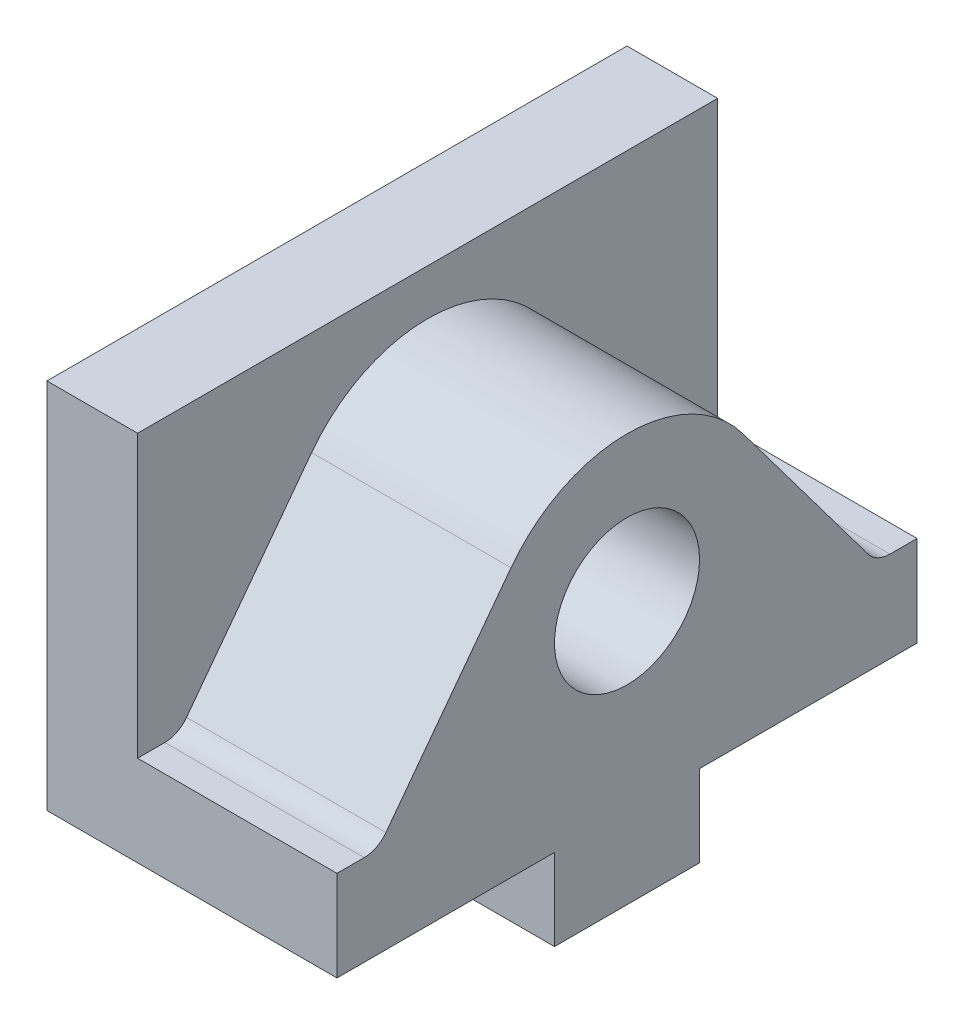
ISO-10303-21;
HEADER;
FILE_DESCRIPTION(('STEP AP214'),'2;1');
FILE_NAME('part.step','',(''),(''),'','','');
FILE_SCHEMA(('AUTOMOTIVE_DESIGN { 1 0 10303 214 1 1 1 1 }'));
ENDSEC;
DATA;
#1=APPLICATION_CONTEXT('core data for automotive mechanical design processes');
#2=APPLICATION_PROTOCOL_DEFINITION('international standard','automotive_design',2000,#1);
#3=PRODUCT_CONTEXT('',#1,'mechanical');
#4=PRODUCT('Part','Part','',(#3));
#5=PRODUCT_RELATED_PRODUCT_CATEGORY('part','',(#4));
#6=PRODUCT_DEFINITION_FORMATION('','',#4);
#7=PRODUCT_DEFINITION_CONTEXT('part definition',#1,'design');
#8=PRODUCT_DEFINITION('design','',#6,#7);
#9=PRODUCT_DEFINITION_SHAPE('','',#8);
#10=(LENGTH_UNIT() NAMED_UNIT(*) SI_UNIT(.MILLI.,.METRE.));
#11=(NAMED_UNIT(*) PLANE_ANGLE_UNIT() SI_UNIT($,.RADIAN.));
#12=(NAMED_UNIT(*) SI_UNIT($,.STERADIAN.) SOLID_ANGLE_UNIT());
#13=UNCERTAINTY_MEASURE_WITH_UNIT(LENGTH_MEASURE(1.E-05),#10,'distance_accuracy_value','');
#14=(GEOMETRIC_REPRESENTATION_CONTEXT(3) GLOBAL_UNCERTAINTY_ASSIGNED_CONTEXT((#13)) GLOBAL_UNIT_ASSIGNED_CONTEXT((#10,
#11,#12)) REPRESENTATION_CONTEXT('',''));
#15=CARTESIAN_POINT('',(0.,0.,0.));
#16=DIRECTION('',(0.,0.,1.));
#17=DIRECTION('',(1.,0.,0.));
#18=AXIS2_PLACEMENT_3D('',#15,#16,#17);
#19=CARTESIAN_POINT('',(22.,-27.,0.));
#20=DIRECTION('',(0.,1.,0.));
#21=DIRECTION('',(0.,0.,1.));
#22=AXIS2_PLACEMENT_3D('',#19,#20,#21);
#23=PLANE('',#22);
#24=DIRECTION('',(-1.,0.,0.));
#25=VECTOR('',#24,1.);
#26=CARTESIAN_POINT('',(22.,-27.,8.));
#27=LINE('',#26,#25);
#28=CARTESIAN_POINT('',(22.,-27.,8.));
#29=VERTEX_POINT('',#28);
#30=CARTESIAN_POINT('',(-10.,-27.,8.));
#31=VERTEX_POINT('',#30);
#32=EDGE_CURVE('E237',#29,#31,#27,.T.);
#33=ORIENTED_EDGE('',*,*,#32,.T.);
#34=DIRECTION('',(0.,0.,1.));
#35=VECTOR('',#34,1.);
#36=CARTESIAN_POINT('',(-10.,-27.,0.));
#37=LINE('',#36,#35);
#38=CARTESIAN_POINT('',(-10.,-27.,-8.));
#39=VERTEX_POINT('',#38);
#40=EDGE_CURVE('E188',#39,#31,#37,.T.);
#41=ORIENTED_EDGE('',*,*,#40,.F.);
#42=DIRECTION('',(-1.,0.,0.));
#43=VECTOR('',#42,1.);
#44=CARTESIAN_POINT('',(22.,-27.,-8.));
#45=LINE('',#44,#43);
#46=CARTESIAN_POINT('',(22.,-27.,-8.));
#47=VERTEX_POINT('',#46);
#48=EDGE_CURVE('E11',#47,#39,#45,.T.);
#49=ORIENTED_EDGE('',*,*,#48,.F.);
#50=DIRECTION('',(0.,0.,-1.));
#51=VECTOR('',#50,1.);
#52=CARTESIAN_POINT('',(22.,-27.,0.));
#53=LINE('',#52,#51);
#54=EDGE_CURVE('E160',#29,#47,#53,.T.);
#55=ORIENTED_EDGE('',*,*,#54,.F.);
#56=EDGE_LOOP('',(#33,#41,#49,#55));
#57=FACE_BOUND('',#56,.T.);
#58=ADVANCED_FACE('F34',(#57),#23,.F.);
#59=CARTESIAN_POINT('',(22.,0.,-7.99999999999998));
#60=DIRECTION('',(0.,0.,1.));
#61=DIRECTION('',(0.,-1.,0.));
#62=AXIS2_PLACEMENT_3D('',#59,#60,#61);
#63=PLANE('',#62);
#64=ORIENTED_EDGE('',*,*,#48,.T.);
#65=DIRECTION('',(0.,-1.,0.));
#66=VECTOR('',#65,1.);
#67=CARTESIAN_POINT('',(-10.,0.,-7.99999999999998));
#68=LINE('',#67,#66);
#69=CARTESIAN_POINT('',(-10.,-18.,-7.99999999999999));
#70=VERTEX_POINT('',#69);
#71=EDGE_CURVE('E191',#70,#39,#68,.T.);
#72=ORIENTED_EDGE('',*,*,#71,.F.);
#73=DIRECTION('',(-1.,0.,0.));
#74=VECTOR('',#73,1.);
#75=CARTESIAN_POINT('',(22.,-18.,-8.));
#76=LINE('',#75,#74);
#77=CARTESIAN_POINT('',(22.,-18.,-8.));
#78=VERTEX_POINT('',#77);
#79=EDGE_CURVE('E42',#78,#70,#76,.T.);
#80=ORIENTED_EDGE('',*,*,#79,.F.);
#81=DIRECTION('',(0.,1.,0.));
#82=VECTOR('',#81,1.);
#83=CARTESIAN_POINT('',(22.,0.,-7.99999999999998));
#84=LINE('',#83,#82);
#85=EDGE_CURVE('E92',#47,#78,#84,.T.);
#86=ORIENTED_EDGE('',*,*,#85,.F.);
#87=EDGE_LOOP('',(#64,#72,#80,#86));
#88=FACE_BOUND('',#87,.T.);
#89=ADVANCED_FACE('F268',(#88),#63,.F.);
#90=CARTESIAN_POINT('',(22.,-18.,0.));
#91=DIRECTION('',(0.,1.,0.));
#92=DIRECTION('',(0.,0.,1.));
#93=AXIS2_PLACEMENT_3D('',#90,#91,#92);
#94=PLANE('',#93);
#95=ORIENTED_EDGE('',*,*,#79,.T.);
#96=DIRECTION('',(0.,0.,1.));
#97=VECTOR('',#96,1.);
#98=CARTESIAN_POINT('',(-10.,-18.,0.));
#99=LINE('',#98,#97);
#100=CARTESIAN_POINT('',(-10.,-18.,-32.));
#101=VERTEX_POINT('',#100);
#102=EDGE_CURVE('E194',#101,#70,#99,.T.);
#103=ORIENTED_EDGE('',*,*,#102,.F.);
#104=DIRECTION('',(-1.,0.,0.));
#105=VECTOR('',#104,1.);
#106=CARTESIAN_POINT('',(22.,-18.,-32.));
#107=LINE('',#106,#105);
#108=CARTESIAN_POINT('',(22.,-18.,-32.));
#109=VERTEX_POINT('',#108);
#110=EDGE_CURVE('E209',#109,#101,#107,.T.);
#111=ORIENTED_EDGE('',*,*,#110,.F.);
#112=DIRECTION('',(0.,0.,-1.));
#113=VECTOR('',#112,1.);
#114=CARTESIAN_POINT('',(22.,-18.,0.));
#115=LINE('',#114,#113);
#116=EDGE_CURVE('E149',#78,#109,#115,.T.);
#117=ORIENTED_EDGE('',*,*,#116,.F.);
#118=EDGE_LOOP('',(#95,#103,#111,#117));
#119=FACE_BOUND('',#118,.T.);
#120=ADVANCED_FACE('F267',(#119),#94,.F.);
#121=CARTESIAN_POINT('',(22.,0.,-32.));
#122=DIRECTION('',(0.,0.,-1.));
#123=DIRECTION('',(-1.,0.,0.));
#124=AXIS2_PLACEMENT_3D('',#121,#122,#123);
#125=PLANE('',#124);
#126=ORIENTED_EDGE('',*,*,#110,.T.);
#127=DIRECTION('',(0.,1.,0.));
#128=VECTOR('',#127,1.);
#129=CARTESIAN_POINT('',(-10.,0.,-32.));
#130=LINE('',#129,#128);
#131=CARTESIAN_POINT('',(-10.,23.0518467528275,-32.));
#132=VERTEX_POINT('',#131);
#133=EDGE_CURVE('E175',#101,#132,#130,.T.);
#134=ORIENTED_EDGE('',*,*,#133,.T.);
#135=DIRECTION('',(1.,0.,0.));
#136=VECTOR('',#135,1.);
#137=CARTESIAN_POINT('',(-10.,23.0518467528275,-32.));
#138=LINE('',#137,#136);
#139=CARTESIAN_POINT('',(0.,23.0518467528275,-32.));
#140=VERTEX_POINT('',#139);
#141=EDGE_CURVE('E168',#132,#140,#138,.T.);
#142=ORIENTED_EDGE('',*,*,#141,.T.);
#143=DIRECTION('',(0.,1.,0.));
#144=VECTOR('',#143,1.);
#145=CARTESIAN_POINT('',(0.,0.,-32.));
#146=LINE('',#145,#144);
#147=CARTESIAN_POINT('',(0.,-8.00000000000001,-32.));
#148=VERTEX_POINT('',#147);
#149=EDGE_CURVE('E178',#148,#140,#146,.T.);
#150=ORIENTED_EDGE('',*,*,#149,.F.);
#151=DIRECTION('',(-1.,0.,0.));
#152=VECTOR('',#151,1.);
#153=CARTESIAN_POINT('',(22.,-8.00000000000001,-32.));
#154=LINE('',#153,#152);
#155=CARTESIAN_POINT('',(22.,-8.00000000000001,-32.));
#156=VERTEX_POINT('',#155);
#157=EDGE_CURVE('E263',#156,#148,#154,.T.);
#158=ORIENTED_EDGE('',*,*,#157,.F.);
#159=DIRECTION('',(0.,-1.,0.));
#160=VECTOR('',#159,1.);
#161=CARTESIAN_POINT('',(22.,0.,-32.));
#162=LINE('',#161,#160);
#163=EDGE_CURVE('E154',#156,#109,#162,.T.);
#164=ORIENTED_EDGE('',*,*,#163,.T.);
#165=EDGE_LOOP('',(#126,#134,#142,#150,#158,#164));
#166=FACE_BOUND('',#165,.T.);
#167=ADVANCED_FACE('F203',(#166),#125,.T.);
#168=CARTESIAN_POINT('',(22.,-8.00000000000001,0.));
#169=DIRECTION('',(0.,1.,0.));
#170=DIRECTION('',(0.,0.,1.));
#171=AXIS2_PLACEMENT_3D('',#168,#169,#170);
#172=PLANE('',#171);
#173=DIRECTION('',(0.,0.,-1.));
#174=VECTOR('',#173,1.);
#175=CARTESIAN_POINT('',(0.,-8.00000000000001,0.));
#176=LINE('',#175,#174);
#177=CARTESIAN_POINT('',(0.,-8.00000000000001,-29.));
#178=VERTEX_POINT('',#177);
#179=EDGE_CURVE('E167',#178,#148,#176,.T.);
#180=ORIENTED_EDGE('',*,*,#179,.F.);
#181=DIRECTION('',(-1.,0.,0.));
#182=VECTOR('',#181,1.);
#183=CARTESIAN_POINT('',(22.,-8.00000000000001,-29.));
#184=LINE('',#183,#182);
#185=CARTESIAN_POINT('',(22.,-8.00000000000001,-29.));
#186=VERTEX_POINT('',#185);
#187=EDGE_CURVE('E261',#186,#178,#184,.T.);
#188=ORIENTED_EDGE('',*,*,#187,.F.);
#189=DIRECTION('',(0.,0.,-1.));
#190=VECTOR('',#189,1.);
#191=CARTESIAN_POINT('',(22.,-8.00000000000001,0.));
#192=LINE('',#191,#190);
#193=EDGE_CURVE('E159',#186,#156,#192,.T.);
#194=ORIENTED_EDGE('',*,*,#193,.T.);
#195=ORIENTED_EDGE('',*,*,#157,.T.);
#196=EDGE_LOOP('',(#180,#188,#194,#195));
#197=FACE_BOUND('',#196,.T.);
#198=ADVANCED_FACE('F278',(#197),#172,.T.);
#199=CARTESIAN_POINT('',(22.,-5.00000000000002,-29.));
#200=DIRECTION('',(-1.,0.,0.));
#201=DIRECTION('',(0.,0.,1.));
#202=AXIS2_PLACEMENT_3D('',#199,#200,#201);
#203=CYLINDRICAL_SURFACE('',#202,2.99999999999999);
#204=CARTESIAN_POINT('',(0.,-5.00000000000002,-29.));
#205=DIRECTION('',(1.,0.,0.));
#206=DIRECTION('',(0.,0.,-1.));
#207=AXIS2_PLACEMENT_3D('',#204,#205,#206);
#208=CIRCLE('',#207,2.99999999999999);
#209=CARTESIAN_POINT('',(0.,-6.80000000000001,-26.6));
#210=VERTEX_POINT('',#209);
#211=EDGE_CURVE('E524',#210,#178,#208,.T.);
#212=ORIENTED_EDGE('',*,*,#211,.F.);
#213=DIRECTION('',(-1.,0.,0.));
#214=VECTOR('',#213,1.);
#215=CARTESIAN_POINT('',(22.,-6.80000000000001,-26.6));
#216=LINE('',#215,#214);
#217=CARTESIAN_POINT('',(22.,-6.80000000000001,-26.6));
#218=VERTEX_POINT('',#217);
#219=EDGE_CURVE('E259',#218,#210,#216,.T.);
#220=ORIENTED_EDGE('',*,*,#219,.F.);
#221=CARTESIAN_POINT('',(22.,-5.00000000000002,-29.));
#222=DIRECTION('',(1.,0.,0.));
#223=DIRECTION('',(0.,0.,-1.));
#224=AXIS2_PLACEMENT_3D('',#221,#222,#223);
#225=CIRCLE('',#224,2.99999999999999);
#226=EDGE_CURVE('E551',#218,#186,#225,.T.);
#227=ORIENTED_EDGE('',*,*,#226,.T.);
#228=ORIENTED_EDGE('',*,*,#187,.T.);
#229=EDGE_LOOP('',(#212,#220,#227,#228));
#230=FACE_BOUND('',#229,.T.);
#231=ADVANCED_FACE('F279',(#230),#203,.F.);
#232=CARTESIAN_POINT('',(22.,10.32,-13.76));
#233=DIRECTION('',(0.,-0.6,0.8));
#234=DIRECTION('',(0.,-0.8,-0.6));
#235=AXIS2_PLACEMENT_3D('',#232,#233,#234);
#236=PLANE('',#235);
#237=DIRECTION('',(0.,0.8,0.6));
#238=VECTOR('',#237,1.);
#239=CARTESIAN_POINT('',(0.,10.32,-13.76));
#240=LINE('',#239,#238);
#241=CARTESIAN_POINT('',(0.,11.6,-12.8));
#242=VERTEX_POINT('',#241);
#243=EDGE_CURVE('E531',#210,#242,#240,.T.);
#244=ORIENTED_EDGE('',*,*,#243,.T.);
#245=DIRECTION('',(-1.,0.,0.));
#246=VECTOR('',#245,1.);
#247=CARTESIAN_POINT('',(22.,11.6,-12.8));
#248=LINE('',#247,#246);
#249=CARTESIAN_POINT('',(22.,11.6,-12.8));
#250=VERTEX_POINT('',#249);
#251=EDGE_CURVE('E256',#250,#242,#248,.T.);
#252=ORIENTED_EDGE('',*,*,#251,.F.);
#253=DIRECTION('',(0.,0.8,0.6));
#254=VECTOR('',#253,1.);
#255=CARTESIAN_POINT('',(22.,10.32,-13.76));
#256=LINE('',#255,#254);
#257=EDGE_CURVE('E553',#218,#250,#256,.T.);
#258=ORIENTED_EDGE('',*,*,#257,.F.);
#259=ORIENTED_EDGE('',*,*,#219,.T.);
#260=EDGE_LOOP('',(#244,#252,#258,#259));
#261=FACE_BOUND('',#260,.T.);
#262=ADVANCED_FACE('F282',(#261),#236,.F.);
#263=CARTESIAN_POINT('',(22.,1.99999999999999,0.));
#264=DIRECTION('',(-1.,0.,0.));
#265=DIRECTION('',(0.,0.,1.));
#266=AXIS2_PLACEMENT_3D('',#263,#264,#265);
#267=CYLINDRICAL_SURFACE('',#266,16.);
#268=CARTESIAN_POINT('',(0.,1.99999999999999,0.));
#269=DIRECTION('',(1.,0.,0.));
#270=DIRECTION('',(0.,0.,-1.));
#271=AXIS2_PLACEMENT_3D('',#268,#269,#270);
#272=CIRCLE('',#271,16.);
#273=CARTESIAN_POINT('',(0.,11.6,12.8));
#274=VERTEX_POINT('',#273);
#275=EDGE_CURVE('E533',#242,#274,#272,.T.);
#276=ORIENTED_EDGE('',*,*,#275,.T.);
#277=DIRECTION('',(-1.,0.,0.));
#278=VECTOR('',#277,1.);
#279=CARTESIAN_POINT('',(22.,11.6,12.8));
#280=LINE('',#279,#278);
#281=CARTESIAN_POINT('',(22.,11.6,12.8));
#282=VERTEX_POINT('',#281);
#283=EDGE_CURVE('E254',#282,#274,#280,.T.);
#284=ORIENTED_EDGE('',*,*,#283,.F.);
#285=CARTESIAN_POINT('',(22.,1.99999999999999,0.));
#286=DIRECTION('',(1.,0.,0.));
#287=DIRECTION('',(0.,0.,-1.));
#288=AXIS2_PLACEMENT_3D('',#285,#286,#287);
#289=CIRCLE('',#288,16.);
#290=EDGE_CURVE('E555',#250,#282,#289,.T.);
#291=ORIENTED_EDGE('',*,*,#290,.F.);
#292=ORIENTED_EDGE('',*,*,#251,.T.);
#293=EDGE_LOOP('',(#276,#284,#291,#292));
#294=FACE_BOUND('',#293,.T.);
#295=ADVANCED_FACE('F286',(#294),#267,.T.);
#296=CARTESIAN_POINT('',(22.,10.32,13.76));
#297=DIRECTION('',(0.,0.6,0.8));
#298=DIRECTION('',(0.,-0.8,0.6));
#299=AXIS2_PLACEMENT_3D('',#296,#297,#298);
#300=PLANE('',#299);
#301=DIRECTION('',(0.,0.8,-0.6));
#302=VECTOR('',#301,1.);
#303=CARTESIAN_POINT('',(0.,10.32,13.76));
#304=LINE('',#303,#302);
#305=CARTESIAN_POINT('',(0.,-6.80000000000001,26.6));
#306=VERTEX_POINT('',#305);
#307=EDGE_CURVE('E538',#306,#274,#304,.T.);
#308=ORIENTED_EDGE('',*,*,#307,.F.);
#309=DIRECTION('',(-1.,0.,0.));
#310=VECTOR('',#309,1.);
#311=CARTESIAN_POINT('',(22.,-6.80000000000001,26.6));
#312=LINE('',#311,#310);
#313=CARTESIAN_POINT('',(22.,-6.80000000000001,26.6));
#314=VERTEX_POINT('',#313);
#315=EDGE_CURVE('E252',#314,#306,#312,.T.);
#316=ORIENTED_EDGE('',*,*,#315,.F.);
#317=DIRECTION('',(0.,0.8,-0.6));
#318=VECTOR('',#317,1.);
#319=CARTESIAN_POINT('',(22.,10.32,13.76));
#320=LINE('',#319,#318);
#321=EDGE_CURVE('E548',#314,#282,#320,.T.);
#322=ORIENTED_EDGE('',*,*,#321,.T.);
#323=ORIENTED_EDGE('',*,*,#283,.T.);
#324=EDGE_LOOP('',(#308,#316,#322,#323));
#325=FACE_BOUND('',#324,.T.);
#326=ADVANCED_FACE('F290',(#325),#300,.T.);
#327=CARTESIAN_POINT('',(22.,-5.00000000000002,29.));
#328=DIRECTION('',(-1.,0.,0.));
#329=DIRECTION('',(0.,0.,1.));
#330=AXIS2_PLACEMENT_3D('',#327,#328,#329);
#331=CYLINDRICAL_SURFACE('',#330,2.99999999999999);
#332=CARTESIAN_POINT('',(0.,-5.00000000000002,29.));
#333=DIRECTION('',(1.,0.,0.));
#334=DIRECTION('',(0.,0.,-1.));
#335=AXIS2_PLACEMENT_3D('',#332,#333,#334);
#336=CIRCLE('',#335,2.99999999999999);
#337=CARTESIAN_POINT('',(0.,-8.00000000000001,29.));
#338=VERTEX_POINT('',#337);
#339=EDGE_CURVE('E540',#306,#338,#336,.F.);
#340=ORIENTED_EDGE('',*,*,#339,.T.);
#341=DIRECTION('',(-1.,0.,0.));
#342=VECTOR('',#341,1.);
#343=CARTESIAN_POINT('',(22.,-8.00000000000001,29.));
#344=LINE('',#343,#342);
#345=CARTESIAN_POINT('',(22.,-8.00000000000001,29.));
#346=VERTEX_POINT('',#345);
#347=EDGE_CURVE('E77',#346,#338,#344,.T.);
#348=ORIENTED_EDGE('',*,*,#347,.F.);
#349=CARTESIAN_POINT('',(22.,-5.00000000000002,29.));
#350=DIRECTION('',(1.,0.,0.));
#351=DIRECTION('',(0.,0.,-1.));
#352=AXIS2_PLACEMENT_3D('',#349,#350,#351);
#353=CIRCLE('',#352,2.99999999999999);
#354=EDGE_CURVE('E546',#314,#346,#353,.F.);
#355=ORIENTED_EDGE('',*,*,#354,.F.);
#356=ORIENTED_EDGE('',*,*,#315,.T.);
#357=EDGE_LOOP('',(#340,#348,#355,#356));
#358=FACE_BOUND('',#357,.T.);
#359=ADVANCED_FACE('F294',(#358),#331,.F.);
#360=CARTESIAN_POINT('',(0.,-8.00000000000001,32.));
#361=VERTEX_POINT('',#360);
#362=EDGE_CURVE('E526',#361,#338,#176,.T.);
#363=ORIENTED_EDGE('',*,*,#362,.F.);
#364=DIRECTION('',(-1.,0.,0.));
#365=VECTOR('',#364,1.);
#366=CARTESIAN_POINT('',(22.,-8.00000000000001,32.));
#367=LINE('',#366,#365);
#368=CARTESIAN_POINT('',(22.,-8.00000000000001,32.));
#369=VERTEX_POINT('',#368);
#370=EDGE_CURVE('E85',#369,#361,#367,.T.);
#371=ORIENTED_EDGE('',*,*,#370,.F.);
#372=EDGE_CURVE('E131',#369,#346,#192,.T.);
#373=ORIENTED_EDGE('',*,*,#372,.T.);
#374=ORIENTED_EDGE('',*,*,#347,.T.);
#375=EDGE_LOOP('',(#363,#371,#373,#374));
#376=FACE_BOUND('',#375,.T.);
#377=ADVANCED_FACE('F298',(#376),#172,.T.);
#378=CARTESIAN_POINT('',(22.,0.,32.));
#379=DIRECTION('',(0.,0.,-1.));
#380=DIRECTION('',(-1.,0.,0.));
#381=AXIS2_PLACEMENT_3D('',#378,#379,#380);
#382=PLANE('',#381);
#383=ORIENTED_EDGE('',*,*,#370,.T.);
#384=DIRECTION('',(0.,1.,0.));
#385=VECTOR('',#384,1.);
#386=CARTESIAN_POINT('',(0.,0.,32.));
#387=LINE('',#386,#385);
#388=CARTESIAN_POINT('',(0.,23.0518467528275,32.));
#389=VERTEX_POINT('',#388);
#390=EDGE_CURVE('E176',#361,#389,#387,.T.);
#391=ORIENTED_EDGE('',*,*,#390,.T.);
#392=DIRECTION('',(1.,0.,0.));
#393=VECTOR('',#392,1.);
#394=CARTESIAN_POINT('',(-10.,23.0518467528275,32.));
#395=LINE('',#394,#393);
#396=CARTESIAN_POINT('',(-10.,23.0518467528275,32.));
#397=VERTEX_POINT('',#396);
#398=EDGE_CURVE('E164',#397,#389,#395,.T.);
#399=ORIENTED_EDGE('',*,*,#398,.F.);
#400=DIRECTION('',(0.,1.,0.));
#401=VECTOR('',#400,1.);
#402=CARTESIAN_POINT('',(-10.,0.,32.));
#403=LINE('',#402,#401);
#404=CARTESIAN_POINT('',(-10.,-18.,32.));
#405=VERTEX_POINT('',#404);
#406=EDGE_CURVE('E140',#405,#397,#403,.T.);
#407=ORIENTED_EDGE('',*,*,#406,.F.);
#408=DIRECTION('',(-1.,0.,0.));
#409=VECTOR('',#408,1.);
#410=CARTESIAN_POINT('',(22.,-18.,32.));
#411=LINE('',#410,#409);
#412=CARTESIAN_POINT('',(22.,-18.,32.));
#413=VERTEX_POINT('',#412);
#414=EDGE_CURVE('E135',#413,#405,#411,.T.);
#415=ORIENTED_EDGE('',*,*,#414,.F.);
#416=DIRECTION('',(0.,-1.,0.));
#417=VECTOR('',#416,1.);
#418=CARTESIAN_POINT('',(22.,0.,32.));
#419=LINE('',#418,#417);
#420=EDGE_CURVE('E124',#369,#413,#419,.T.);
#421=ORIENTED_EDGE('',*,*,#420,.F.);
#422=EDGE_LOOP('',(#383,#391,#399,#407,#415,#421));
#423=FACE_BOUND('',#422,.T.);
#424=ADVANCED_FACE('F136',(#423),#382,.F.);
#425=ORIENTED_EDGE('',*,*,#414,.T.);
#426=CARTESIAN_POINT('',(-10.,-18.,8.));
#427=VERTEX_POINT('',#426);
#428=EDGE_CURVE('E184',#427,#405,#99,.T.);
#429=ORIENTED_EDGE('',*,*,#428,.F.);
#430=DIRECTION('',(-1.,0.,0.));
#431=VECTOR('',#430,1.);
#432=CARTESIAN_POINT('',(22.,-18.,8.));
#433=LINE('',#432,#431);
#434=CARTESIAN_POINT('',(22.,-18.,8.));
#435=VERTEX_POINT('',#434);
#436=EDGE_CURVE('E144',#435,#427,#433,.T.);
#437=ORIENTED_EDGE('',*,*,#436,.F.);
#438=EDGE_CURVE('E129',#413,#435,#115,.T.);
#439=ORIENTED_EDGE('',*,*,#438,.F.);
#440=EDGE_LOOP('',(#425,#429,#437,#439));
#441=FACE_BOUND('',#440,.T.);
#442=ADVANCED_FACE('F146',(#441),#94,.F.);
#443=CARTESIAN_POINT('',(22.,0.,8.00000000000002));
#444=DIRECTION('',(0.,0.,-1.));
#445=DIRECTION('',(0.,1.,0.));
#446=AXIS2_PLACEMENT_3D('',#443,#444,#445);
#447=PLANE('',#446);
#448=ORIENTED_EDGE('',*,*,#436,.T.);
#449=DIRECTION('',(0.,1.,0.));
#450=VECTOR('',#449,1.);
#451=CARTESIAN_POINT('',(-10.,0.,8.00000000000002));
#452=LINE('',#451,#450);
#453=EDGE_CURVE('E185',#31,#427,#452,.T.);
#454=ORIENTED_EDGE('',*,*,#453,.F.);
#455=ORIENTED_EDGE('',*,*,#32,.F.);
#456=DIRECTION('',(0.,-1.,0.));
#457=VECTOR('',#456,1.);
#458=CARTESIAN_POINT('',(22.,0.,8.00000000000002));
#459=LINE('',#458,#457);
#460=EDGE_CURVE('E50',#435,#29,#459,.T.);
#461=ORIENTED_EDGE('',*,*,#460,.F.);
#462=EDGE_LOOP('',(#448,#454,#455,#461));
#463=FACE_BOUND('',#462,.T.);
#464=ADVANCED_FACE('F236',(#463),#447,.F.);
#465=CARTESIAN_POINT('',(22.,1.99999999999999,0.));
#466=DIRECTION('',(-1.,0.,0.));
#467=DIRECTION('',(0.,0.,1.));
#468=AXIS2_PLACEMENT_3D('',#465,#466,#467);
#469=CYLINDRICAL_SURFACE('',#468,8.);
#470=CARTESIAN_POINT('',(22.,1.99999999999999,0.));
#471=DIRECTION('',(1.,0.,0.));
#472=DIRECTION('',(0.,0.,-1.));
#473=AXIS2_PLACEMENT_3D('',#470,#471,#472);
#474=CIRCLE('',#473,8.);
#475=CARTESIAN_POINT('',(22.,1.99999999999999,-8.));
#476=VERTEX_POINT('',#475);
#477=EDGE_CURVE('E150',#476,#476,#474,.T.);
#478=ORIENTED_EDGE('',*,*,#477,.T.);
#479=EDGE_LOOP('',(#478));
#480=FACE_BOUND('',#479,.T.);
#481=CARTESIAN_POINT('',(0.,1.99999999999999,0.));
#482=DIRECTION('',(1.,0.,0.));
#483=DIRECTION('',(0.,0.,-1.));
#484=AXIS2_PLACEMENT_3D('',#481,#482,#483);
#485=CIRCLE('',#484,8.);
#486=CARTESIAN_POINT('',(0.,1.99999999999999,-8.));
#487=VERTEX_POINT('',#486);
#488=EDGE_CURVE('E161',#487,#487,#485,.T.);
#489=ORIENTED_EDGE('',*,*,#488,.F.);
#490=EDGE_LOOP('',(#489));
#491=FACE_BOUND('',#490,.T.);
#492=ADVANCED_FACE('F307',(#480,#491),#469,.F.);
#493=CARTESIAN_POINT('',(22.,0.,0.));
#494=DIRECTION('',(1.,0.,0.));
#495=DIRECTION('',(0.,0.,-1.));
#496=AXIS2_PLACEMENT_3D('',#493,#494,#495);
#497=PLANE('',#496);
#498=ORIENTED_EDGE('',*,*,#54,.T.);
#499=ORIENTED_EDGE('',*,*,#85,.T.);
#500=ORIENTED_EDGE('',*,*,#116,.T.);
#501=ORIENTED_EDGE('',*,*,#163,.F.);
#502=ORIENTED_EDGE('',*,*,#193,.F.);
#503=ORIENTED_EDGE('',*,*,#226,.F.);
#504=ORIENTED_EDGE('',*,*,#257,.T.);
#505=ORIENTED_EDGE('',*,*,#290,.T.);
#506=ORIENTED_EDGE('',*,*,#321,.F.);
#507=ORIENTED_EDGE('',*,*,#354,.T.);
#508=ORIENTED_EDGE('',*,*,#372,.F.);
#509=ORIENTED_EDGE('',*,*,#420,.T.);
#510=ORIENTED_EDGE('',*,*,#438,.T.);
#511=ORIENTED_EDGE('',*,*,#460,.T.);
#512=EDGE_LOOP('',(#498,#499,#500,#501,#502,#503,#504,#505,#506,#507,#508,#509,#510,#511));
#513=FACE_BOUND('',#512,.T.);
#514=ORIENTED_EDGE('',*,*,#477,.F.);
#515=EDGE_LOOP('',(#514));
#516=FACE_BOUND('',#515,.T.);
#517=ADVANCED_FACE('F126',(#513,#516),#497,.T.);
#518=CARTESIAN_POINT('',(0.,0.,0.));
#519=DIRECTION('',(-1.,0.,0.));
#520=DIRECTION('',(0.,0.,1.));
#521=AXIS2_PLACEMENT_3D('',#518,#519,#520);
#522=PLANE('',#521);
#523=ORIENTED_EDGE('',*,*,#488,.T.);
#524=EDGE_LOOP('',(#523));
#525=FACE_BOUND('',#524,.T.);
#526=ADVANCED_FACE('F313',(#525),#522,.F.);
#527=ORIENTED_EDGE('',*,*,#390,.F.);
#528=ORIENTED_EDGE('',*,*,#362,.T.);
#529=ORIENTED_EDGE('',*,*,#339,.F.);
#530=ORIENTED_EDGE('',*,*,#307,.T.);
#531=ORIENTED_EDGE('',*,*,#275,.F.);
#532=ORIENTED_EDGE('',*,*,#243,.F.);
#533=ORIENTED_EDGE('',*,*,#211,.T.);
#534=ORIENTED_EDGE('',*,*,#179,.T.);
#535=ORIENTED_EDGE('',*,*,#149,.T.);
#536=DIRECTION('',(0.,0.,1.));
#537=VECTOR('',#536,1.);
#538=CARTESIAN_POINT('',(0.,23.0518467528275,0.));
#539=LINE('',#538,#537);
#540=EDGE_CURVE('E172',#140,#389,#539,.T.);
#541=ORIENTED_EDGE('',*,*,#540,.T.);
#542=EDGE_LOOP('',(#527,#528,#529,#530,#531,#532,#533,#534,#535,#541));
#543=FACE_BOUND('',#542,.T.);
#544=ADVANCED_FACE('F316',(#543),#522,.F.);
#545=CARTESIAN_POINT('',(-10.,23.0518467528275,0.));
#546=DIRECTION('',(0.,1.,0.));
#547=DIRECTION('',(0.,0.,1.));
#548=AXIS2_PLACEMENT_3D('',#545,#546,#547);
#549=PLANE('',#548);
#550=ORIENTED_EDGE('',*,*,#540,.F.);
#551=ORIENTED_EDGE('',*,*,#141,.F.);
#552=DIRECTION('',(0.,0.,1.));
#553=VECTOR('',#552,1.);
#554=CARTESIAN_POINT('',(-10.,23.0518467528275,0.));
#555=LINE('',#554,#553);
#556=EDGE_CURVE('E171',#132,#397,#555,.T.);
#557=ORIENTED_EDGE('',*,*,#556,.T.);
#558=ORIENTED_EDGE('',*,*,#398,.T.);
#559=EDGE_LOOP('',(#550,#551,#557,#558));
#560=FACE_BOUND('',#559,.T.);
#561=ADVANCED_FACE('F216',(#560),#549,.T.);
#562=CARTESIAN_POINT('',(-10.,0.,0.));
#563=DIRECTION('',(-1.,0.,0.));
#564=DIRECTION('',(0.,0.,1.));
#565=AXIS2_PLACEMENT_3D('',#562,#563,#564);
#566=PLANE('',#565);
#567=ORIENTED_EDGE('',*,*,#133,.F.);
#568=ORIENTED_EDGE('',*,*,#102,.T.);
#569=ORIENTED_EDGE('',*,*,#71,.T.);
#570=ORIENTED_EDGE('',*,*,#40,.T.);
#571=ORIENTED_EDGE('',*,*,#453,.T.);
#572=ORIENTED_EDGE('',*,*,#428,.T.);
#573=ORIENTED_EDGE('',*,*,#406,.T.);
#574=ORIENTED_EDGE('',*,*,#556,.F.);
#575=EDGE_LOOP('',(#567,#568,#569,#570,#571,#572,#573,#574));
#576=FACE_BOUND('',#575,.T.);
#577=ADVANCED_FACE('F214',(#576),#566,.T.);
#578=CLOSED_SHELL('',(#58,#89,#120,#167,#198,#231,#262,#295,#326,#359,#377,#424,#442,#464,#492,
#517,#526,#544,#561,#577));
#579=MANIFOLD_SOLID_BREP('B2',#578);
#580=ADVANCED_BREP_SHAPE_REPRESENTATION('',(#18,#579),#14);
#581=SHAPE_DEFINITION_REPRESENTATION(#9,#580);
ENDSEC;
END-ISO-10303-21;
